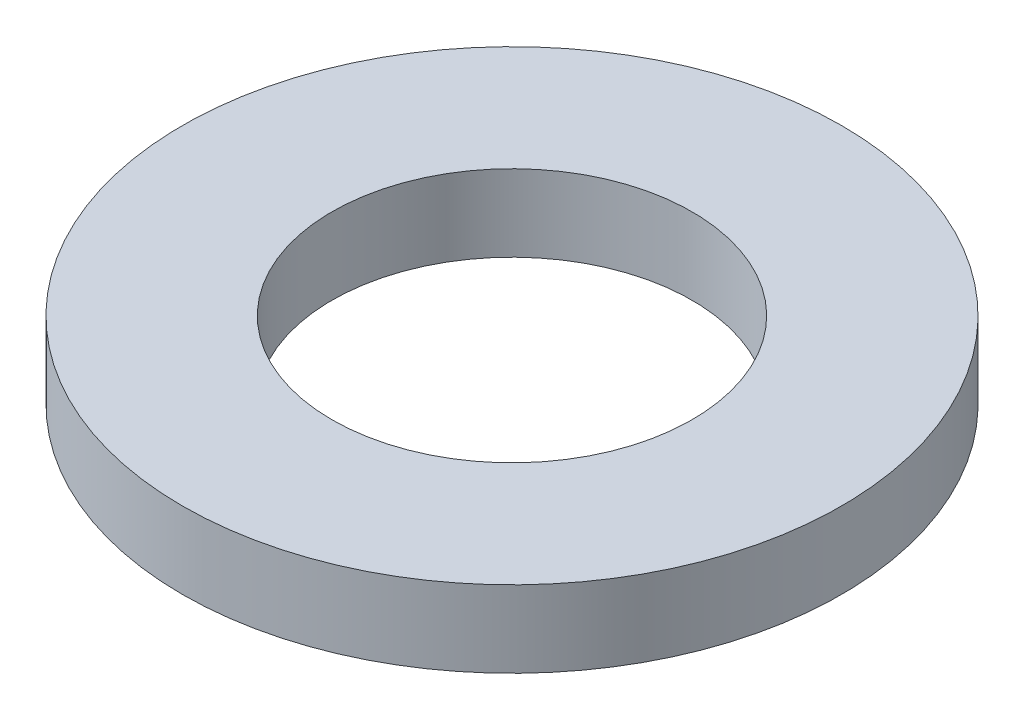
ISO-10303-21;
HEADER;
FILE_DESCRIPTION(('STEP AP214'),'2;1');
FILE_NAME('part.step','',(''),(''),'','','');
FILE_SCHEMA(('AUTOMOTIVE_DESIGN { 1 0 10303 214 1 1 1 1 }'));
ENDSEC;
DATA;
#1=APPLICATION_CONTEXT('core data for automotive mechanical design processes');
#2=APPLICATION_PROTOCOL_DEFINITION('international standard','automotive_design',2000,#1);
#3=PRODUCT_CONTEXT('',#1,'mechanical');
#4=PRODUCT('Part','Part','',(#3));
#5=PRODUCT_RELATED_PRODUCT_CATEGORY('part','',(#4));
#6=PRODUCT_DEFINITION_FORMATION('','',#4);
#7=PRODUCT_DEFINITION_CONTEXT('part definition',#1,'design');
#8=PRODUCT_DEFINITION('design','',#6,#7);
#9=PRODUCT_DEFINITION_SHAPE('','',#8);
#10=(LENGTH_UNIT() NAMED_UNIT(*) SI_UNIT(.MILLI.,.METRE.));
#11=(NAMED_UNIT(*) PLANE_ANGLE_UNIT() SI_UNIT($,.RADIAN.));
#12=(NAMED_UNIT(*) SI_UNIT($,.STERADIAN.) SOLID_ANGLE_UNIT());
#13=UNCERTAINTY_MEASURE_WITH_UNIT(LENGTH_MEASURE(1.E-05),#10,'distance_accuracy_value','');
#14=(GEOMETRIC_REPRESENTATION_CONTEXT(3) GLOBAL_UNCERTAINTY_ASSIGNED_CONTEXT((#13)) GLOBAL_UNIT_ASSIGNED_CONTEXT((#10,
#11,#12)) REPRESENTATION_CONTEXT('',''));
#15=CARTESIAN_POINT('',(0.,0.,0.));
#16=DIRECTION('',(0.,0.,1.));
#17=DIRECTION('',(1.,0.,0.));
#18=AXIS2_PLACEMENT_3D('',#15,#16,#17);
#19=CARTESIAN_POINT('',(0.,0.508,0.));
#20=DIRECTION('',(0.,1.,0.));
#21=DIRECTION('',(0.,0.,1.));
#22=AXIS2_PLACEMENT_3D('',#19,#20,#21);
#23=PLANE('',#22);
#24=CARTESIAN_POINT('',(0.,0.508,0.));
#25=DIRECTION('',(0.,1.,0.));
#26=DIRECTION('',(0.,0.,1.));
#27=AXIS2_PLACEMENT_3D('',#24,#25,#26);
#28=CIRCLE('',#27,2.1844);
#29=CARTESIAN_POINT('',(0.,0.508,2.1844));
#30=VERTEX_POINT('',#29);
#31=EDGE_CURVE('E10',#30,#30,#28,.T.);
#32=ORIENTED_EDGE('',*,*,#31,.T.);
#33=EDGE_LOOP('',(#32));
#34=FACE_BOUND('',#33,.T.);
#35=CARTESIAN_POINT('',(0.,0.508,0.));
#36=DIRECTION('',(0.,1.,0.));
#37=DIRECTION('',(0.,0.,1.));
#38=AXIS2_PLACEMENT_3D('',#35,#36,#37);
#39=CIRCLE('',#38,1.1938);
#40=CARTESIAN_POINT('',(0.,0.508,1.1938));
#41=VERTEX_POINT('',#40);
#42=EDGE_CURVE('E43',#41,#41,#39,.T.);
#43=ORIENTED_EDGE('',*,*,#42,.F.);
#44=EDGE_LOOP('',(#43));
#45=FACE_BOUND('',#44,.T.);
#46=ADVANCED_FACE('F32',(#34,#45),#23,.T.);
#47=CARTESIAN_POINT('',(0.,0.,0.));
#48=DIRECTION('',(0.,1.,0.));
#49=DIRECTION('',(0.,0.,1.));
#50=AXIS2_PLACEMENT_3D('',#47,#48,#49);
#51=PLANE('',#50);
#52=CARTESIAN_POINT('',(0.,0.,0.));
#53=DIRECTION('',(0.,1.,0.));
#54=DIRECTION('',(0.,0.,1.));
#55=AXIS2_PLACEMENT_3D('',#52,#53,#54);
#56=CIRCLE('',#55,2.1844);
#57=CARTESIAN_POINT('',(0.,0.,2.1844));
#58=VERTEX_POINT('',#57);
#59=EDGE_CURVE('E36',#58,#58,#56,.T.);
#60=ORIENTED_EDGE('',*,*,#59,.F.);
#61=EDGE_LOOP('',(#60));
#62=FACE_BOUND('',#61,.T.);
#63=CARTESIAN_POINT('',(0.,0.,0.));
#64=DIRECTION('',(0.,1.,0.));
#65=DIRECTION('',(0.,0.,1.));
#66=AXIS2_PLACEMENT_3D('',#63,#64,#65);
#67=CIRCLE('',#66,1.1938);
#68=CARTESIAN_POINT('',(0.,0.,1.1938));
#69=VERTEX_POINT('',#68);
#70=EDGE_CURVE('E45',#69,#69,#67,.T.);
#71=ORIENTED_EDGE('',*,*,#70,.T.);
#72=EDGE_LOOP('',(#71));
#73=FACE_BOUND('',#72,.T.);
#74=ADVANCED_FACE('F55',(#62,#73),#51,.F.);
#75=CARTESIAN_POINT('',(0.,0.508,0.));
#76=DIRECTION('',(0.,-1.,0.));
#77=DIRECTION('',(0.,0.,-1.));
#78=AXIS2_PLACEMENT_3D('',#75,#76,#77);
#79=CYLINDRICAL_SURFACE('',#78,2.1844);
#80=ORIENTED_EDGE('',*,*,#31,.F.);
#81=EDGE_LOOP('',(#80));
#82=FACE_BOUND('',#81,.T.);
#83=ORIENTED_EDGE('',*,*,#59,.T.);
#84=EDGE_LOOP('',(#83));
#85=FACE_BOUND('',#84,.T.);
#86=ADVANCED_FACE('F34',(#82,#85),#79,.T.);
#87=CARTESIAN_POINT('',(0.,0.508,0.));
#88=DIRECTION('',(0.,-1.,0.));
#89=DIRECTION('',(0.,0.,-1.));
#90=AXIS2_PLACEMENT_3D('',#87,#88,#89);
#91=CYLINDRICAL_SURFACE('',#90,1.1938);
#92=ORIENTED_EDGE('',*,*,#42,.T.);
#93=EDGE_LOOP('',(#92));
#94=FACE_BOUND('',#93,.T.);
#95=ORIENTED_EDGE('',*,*,#70,.F.);
#96=EDGE_LOOP('',(#95));
#97=FACE_BOUND('',#96,.T.);
#98=ADVANCED_FACE('F51',(#94,#97),#91,.F.);
#99=CLOSED_SHELL('',(#46,#74,#86,#98));
#100=MANIFOLD_SOLID_BREP('B2',#99);
#101=ADVANCED_BREP_SHAPE_REPRESENTATION('',(#18,#100),#14);
#102=SHAPE_DEFINITION_REPRESENTATION(#9,#101);
ENDSEC;
END-ISO-10303-21;
